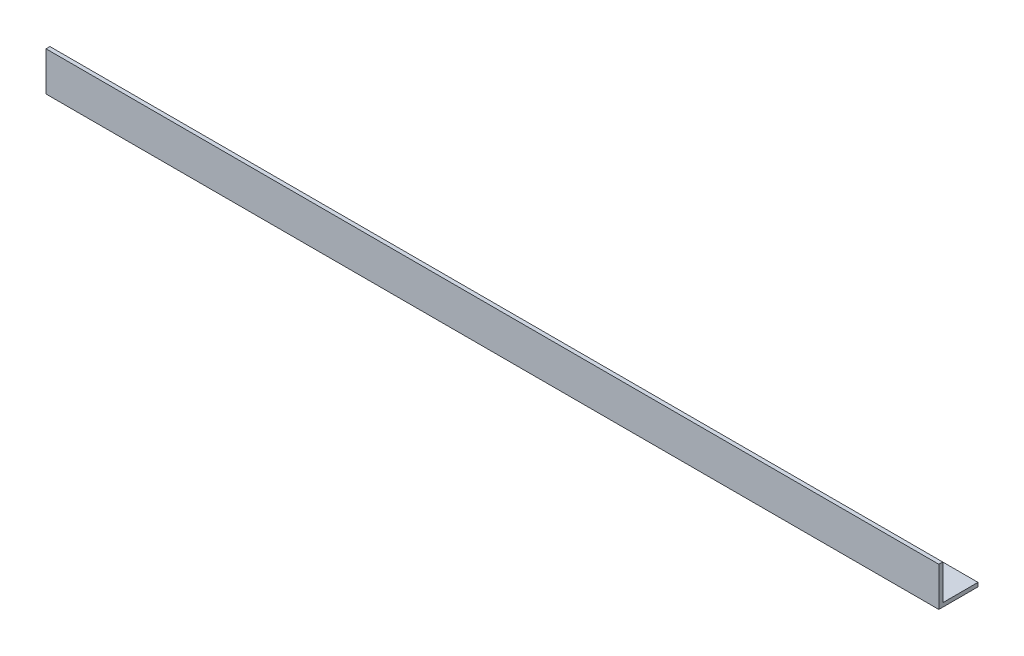
ISO-10303-21;
HEADER;
FILE_DESCRIPTION(('STEP AP214'),'2;1');
FILE_NAME('part.step','',(''),(''),'','','');
FILE_SCHEMA(('AUTOMOTIVE_DESIGN { 1 0 10303 214 1 1 1 1 }'));
ENDSEC;
DATA;
#1=APPLICATION_CONTEXT('core data for automotive mechanical design processes');
#2=APPLICATION_PROTOCOL_DEFINITION('international standard','automotive_design',2000,#1);
#3=PRODUCT_CONTEXT('',#1,'mechanical');
#4=PRODUCT('Part','Part','',(#3));
#5=PRODUCT_RELATED_PRODUCT_CATEGORY('part','',(#4));
#6=PRODUCT_DEFINITION_FORMATION('','',#4);
#7=PRODUCT_DEFINITION_CONTEXT('part definition',#1,'design');
#8=PRODUCT_DEFINITION('design','',#6,#7);
#9=PRODUCT_DEFINITION_SHAPE('','',#8);
#10=(LENGTH_UNIT() NAMED_UNIT(*) SI_UNIT(.MILLI.,.METRE.));
#11=(NAMED_UNIT(*) PLANE_ANGLE_UNIT() SI_UNIT($,.RADIAN.));
#12=(NAMED_UNIT(*) SI_UNIT($,.STERADIAN.) SOLID_ANGLE_UNIT());
#13=UNCERTAINTY_MEASURE_WITH_UNIT(LENGTH_MEASURE(1.E-05),#10,'distance_accuracy_value','');
#14=(GEOMETRIC_REPRESENTATION_CONTEXT(3) GLOBAL_UNCERTAINTY_ASSIGNED_CONTEXT((#13)) GLOBAL_UNIT_ASSIGNED_CONTEXT((#10,
#11,#12)) REPRESENTATION_CONTEXT('',''));
#15=CARTESIAN_POINT('',(0.,0.,0.));
#16=DIRECTION('',(0.,0.,1.));
#17=DIRECTION('',(1.,0.,0.));
#18=AXIS2_PLACEMENT_3D('',#15,#16,#17);
#19=CARTESIAN_POINT('',(342.,0.,-15.));
#20=DIRECTION('',(0.,1.,0.));
#21=DIRECTION('',(0.,0.,1.));
#22=AXIS2_PLACEMENT_3D('',#19,#20,#21);
#23=PLANE('',#22);
#24=DIRECTION('',(0.,0.,-1.));
#25=VECTOR('',#24,1.);
#26=CARTESIAN_POINT('',(0.,0.,-15.));
#27=LINE('',#26,#25);
#28=CARTESIAN_POINT('',(0.,0.,0.));
#29=VERTEX_POINT('',#28);
#30=CARTESIAN_POINT('',(0.,0.,-15.));
#31=VERTEX_POINT('',#30);
#32=EDGE_CURVE('E118',#29,#31,#27,.T.);
#33=ORIENTED_EDGE('',*,*,#32,.T.);
#34=DIRECTION('',(-1.,0.,0.));
#35=VECTOR('',#34,1.);
#36=CARTESIAN_POINT('',(342.,0.,-15.));
#37=LINE('',#36,#35);
#38=CARTESIAN_POINT('',(342.,0.,-15.));
#39=VERTEX_POINT('',#38);
#40=EDGE_CURVE('E11',#39,#31,#37,.T.);
#41=ORIENTED_EDGE('',*,*,#40,.F.);
#42=DIRECTION('',(0.,0.,-1.));
#43=VECTOR('',#42,1.);
#44=CARTESIAN_POINT('',(342.,0.,-15.));
#45=LINE('',#44,#43);
#46=CARTESIAN_POINT('',(342.,0.,0.));
#47=VERTEX_POINT('',#46);
#48=EDGE_CURVE('E128',#47,#39,#45,.T.);
#49=ORIENTED_EDGE('',*,*,#48,.F.);
#50=DIRECTION('',(-1.,0.,0.));
#51=VECTOR('',#50,1.);
#52=CARTESIAN_POINT('',(342.,0.,0.));
#53=LINE('',#52,#51);
#54=EDGE_CURVE('E114',#47,#29,#53,.T.);
#55=ORIENTED_EDGE('',*,*,#54,.T.);
#56=EDGE_LOOP('',(#33,#41,#49,#55));
#57=FACE_BOUND('',#56,.T.);
#58=ADVANCED_FACE('F34',(#57),#23,.F.);
#59=CARTESIAN_POINT('',(342.,1.49999999999998,-15.));
#60=DIRECTION('',(0.,0.,1.));
#61=DIRECTION('',(1.,0.,0.));
#62=AXIS2_PLACEMENT_3D('',#59,#60,#61);
#63=PLANE('',#62);
#64=DIRECTION('',(0.,1.,0.));
#65=VECTOR('',#64,1.);
#66=CARTESIAN_POINT('',(0.,1.49999999999998,-15.));
#67=LINE('',#66,#65);
#68=CARTESIAN_POINT('',(0.,1.49999999999998,-15.));
#69=VERTEX_POINT('',#68);
#70=EDGE_CURVE('E121',#31,#69,#67,.T.);
#71=ORIENTED_EDGE('',*,*,#70,.T.);
#72=DIRECTION('',(-1.,0.,0.));
#73=VECTOR('',#72,1.);
#74=CARTESIAN_POINT('',(342.,1.49999999999998,-15.));
#75=LINE('',#74,#73);
#76=CARTESIAN_POINT('',(342.,1.49999999999998,-15.));
#77=VERTEX_POINT('',#76);
#78=EDGE_CURVE('E42',#77,#69,#75,.T.);
#79=ORIENTED_EDGE('',*,*,#78,.F.);
#80=DIRECTION('',(0.,1.,0.));
#81=VECTOR('',#80,1.);
#82=CARTESIAN_POINT('',(342.,1.49999999999998,-15.));
#83=LINE('',#82,#81);
#84=EDGE_CURVE('E87',#39,#77,#83,.T.);
#85=ORIENTED_EDGE('',*,*,#84,.F.);
#86=ORIENTED_EDGE('',*,*,#40,.T.);
#87=EDGE_LOOP('',(#71,#79,#85,#86));
#88=FACE_BOUND('',#87,.T.);
#89=ADVANCED_FACE('F152',(#88),#63,.F.);
#90=CARTESIAN_POINT('',(342.,1.5,-1.50000000000002));
#91=DIRECTION('',(0.,-1.,0.));
#92=DIRECTION('',(0.,0.,-1.));
#93=AXIS2_PLACEMENT_3D('',#90,#91,#92);
#94=PLANE('',#93);
#95=DIRECTION('',(0.,0.,1.));
#96=VECTOR('',#95,1.);
#97=CARTESIAN_POINT('',(0.,1.5,-1.50000000000002));
#98=LINE('',#97,#96);
#99=CARTESIAN_POINT('',(0.,1.5,-1.50000000000002));
#100=VERTEX_POINT('',#99);
#101=EDGE_CURVE('E123',#69,#100,#98,.T.);
#102=ORIENTED_EDGE('',*,*,#101,.T.);
#103=DIRECTION('',(-1.,0.,0.));
#104=VECTOR('',#103,1.);
#105=CARTESIAN_POINT('',(342.,1.5,-1.50000000000002));
#106=LINE('',#105,#104);
#107=CARTESIAN_POINT('',(342.,1.5,-1.50000000000002));
#108=VERTEX_POINT('',#107);
#109=EDGE_CURVE('E109',#108,#100,#106,.T.);
#110=ORIENTED_EDGE('',*,*,#109,.F.);
#111=DIRECTION('',(0.,0.,1.));
#112=VECTOR('',#111,1.);
#113=CARTESIAN_POINT('',(342.,1.5,-1.50000000000002));
#114=LINE('',#113,#112);
#115=EDGE_CURVE('E100',#77,#108,#114,.T.);
#116=ORIENTED_EDGE('',*,*,#115,.F.);
#117=ORIENTED_EDGE('',*,*,#78,.T.);
#118=EDGE_LOOP('',(#102,#110,#116,#117));
#119=FACE_BOUND('',#118,.T.);
#120=ADVANCED_FACE('F134',(#119),#94,.F.);
#121=CARTESIAN_POINT('',(342.,15.,-1.5));
#122=DIRECTION('',(0.,0.,1.));
#123=DIRECTION('',(0.,-1.,0.));
#124=AXIS2_PLACEMENT_3D('',#121,#122,#123);
#125=PLANE('',#124);
#126=DIRECTION('',(0.,1.,0.));
#127=VECTOR('',#126,1.);
#128=CARTESIAN_POINT('',(0.,15.,-1.5));
#129=LINE('',#128,#127);
#130=CARTESIAN_POINT('',(0.,15.,-1.5));
#131=VERTEX_POINT('',#130);
#132=EDGE_CURVE('E108',#100,#131,#129,.T.);
#133=ORIENTED_EDGE('',*,*,#132,.T.);
#134=DIRECTION('',(-1.,0.,0.));
#135=VECTOR('',#134,1.);
#136=CARTESIAN_POINT('',(342.,15.,-1.5));
#137=LINE('',#136,#135);
#138=CARTESIAN_POINT('',(342.,15.,-1.5));
#139=VERTEX_POINT('',#138);
#140=EDGE_CURVE('E105',#139,#131,#137,.T.);
#141=ORIENTED_EDGE('',*,*,#140,.F.);
#142=DIRECTION('',(0.,1.,0.));
#143=VECTOR('',#142,1.);
#144=CARTESIAN_POINT('',(342.,15.,-1.5));
#145=LINE('',#144,#143);
#146=EDGE_CURVE('E94',#108,#139,#145,.T.);
#147=ORIENTED_EDGE('',*,*,#146,.F.);
#148=ORIENTED_EDGE('',*,*,#109,.T.);
#149=EDGE_LOOP('',(#133,#141,#147,#148));
#150=FACE_BOUND('',#149,.T.);
#151=ADVANCED_FACE('F106',(#150),#125,.F.);
#152=CARTESIAN_POINT('',(342.,15.,0.));
#153=DIRECTION('',(0.,-1.,0.));
#154=DIRECTION('',(0.,0.,-1.));
#155=AXIS2_PLACEMENT_3D('',#152,#153,#154);
#156=PLANE('',#155);
#157=DIRECTION('',(0.,0.,1.));
#158=VECTOR('',#157,1.);
#159=CARTESIAN_POINT('',(0.,15.,0.));
#160=LINE('',#159,#158);
#161=CARTESIAN_POINT('',(0.,15.,0.));
#162=VERTEX_POINT('',#161);
#163=EDGE_CURVE('E73',#131,#162,#160,.T.);
#164=ORIENTED_EDGE('',*,*,#163,.T.);
#165=DIRECTION('',(-1.,0.,0.));
#166=VECTOR('',#165,1.);
#167=CARTESIAN_POINT('',(342.,15.,0.));
#168=LINE('',#167,#166);
#169=CARTESIAN_POINT('',(342.,15.,0.));
#170=VERTEX_POINT('',#169);
#171=EDGE_CURVE('E110',#170,#162,#168,.T.);
#172=ORIENTED_EDGE('',*,*,#171,.F.);
#173=DIRECTION('',(0.,0.,1.));
#174=VECTOR('',#173,1.);
#175=CARTESIAN_POINT('',(342.,15.,0.));
#176=LINE('',#175,#174);
#177=EDGE_CURVE('E98',#139,#170,#176,.T.);
#178=ORIENTED_EDGE('',*,*,#177,.F.);
#179=ORIENTED_EDGE('',*,*,#140,.T.);
#180=EDGE_LOOP('',(#164,#172,#178,#179));
#181=FACE_BOUND('',#180,.T.);
#182=ADVANCED_FACE('F112',(#181),#156,.F.);
#183=CARTESIAN_POINT('',(342.,0.,0.));
#184=DIRECTION('',(0.,0.,-1.));
#185=DIRECTION('',(-1.,0.,0.));
#186=AXIS2_PLACEMENT_3D('',#183,#184,#185);
#187=PLANE('',#186);
#188=DIRECTION('',(0.,-1.,0.));
#189=VECTOR('',#188,1.);
#190=CARTESIAN_POINT('',(0.,0.,0.));
#191=LINE('',#190,#189);
#192=EDGE_CURVE('E79',#162,#29,#191,.T.);
#193=ORIENTED_EDGE('',*,*,#192,.T.);
#194=ORIENTED_EDGE('',*,*,#54,.F.);
#195=DIRECTION('',(0.,-1.,0.));
#196=VECTOR('',#195,1.);
#197=CARTESIAN_POINT('',(342.,0.,0.));
#198=LINE('',#197,#196);
#199=EDGE_CURVE('E50',#170,#47,#198,.T.);
#200=ORIENTED_EDGE('',*,*,#199,.F.);
#201=ORIENTED_EDGE('',*,*,#171,.T.);
#202=EDGE_LOOP('',(#193,#194,#200,#201));
#203=FACE_BOUND('',#202,.T.);
#204=ADVANCED_FACE('F141',(#203),#187,.F.);
#205=CARTESIAN_POINT('',(342.,0.,0.));
#206=DIRECTION('',(-1.,0.,0.));
#207=DIRECTION('',(0.,0.,1.));
#208=AXIS2_PLACEMENT_3D('',#205,#206,#207);
#209=PLANE('',#208);
#210=ORIENTED_EDGE('',*,*,#48,.T.);
#211=ORIENTED_EDGE('',*,*,#84,.T.);
#212=ORIENTED_EDGE('',*,*,#115,.T.);
#213=ORIENTED_EDGE('',*,*,#146,.T.);
#214=ORIENTED_EDGE('',*,*,#177,.T.);
#215=ORIENTED_EDGE('',*,*,#199,.T.);
#216=EDGE_LOOP('',(#210,#211,#212,#213,#214,#215));
#217=FACE_BOUND('',#216,.T.);
#218=ADVANCED_FACE('F96',(#217),#209,.F.);
#219=CARTESIAN_POINT('',(0.,0.,0.));
#220=DIRECTION('',(-1.,0.,0.));
#221=DIRECTION('',(0.,0.,1.));
#222=AXIS2_PLACEMENT_3D('',#219,#220,#221);
#223=PLANE('',#222);
#224=ORIENTED_EDGE('',*,*,#32,.F.);
#225=ORIENTED_EDGE('',*,*,#192,.F.);
#226=ORIENTED_EDGE('',*,*,#163,.F.);
#227=ORIENTED_EDGE('',*,*,#132,.F.);
#228=ORIENTED_EDGE('',*,*,#101,.F.);
#229=ORIENTED_EDGE('',*,*,#70,.F.);
#230=EDGE_LOOP('',(#224,#225,#226,#227,#228,#229));
#231=FACE_BOUND('',#230,.T.);
#232=ADVANCED_FACE('F137',(#231),#223,.T.);
#233=CLOSED_SHELL('',(#58,#89,#120,#151,#182,#204,#218,#232));
#234=MANIFOLD_SOLID_BREP('B2',#233);
#235=ADVANCED_BREP_SHAPE_REPRESENTATION('',(#18,#234),#14);
#236=SHAPE_DEFINITION_REPRESENTATION(#9,#235);
ENDSEC;
END-ISO-10303-21;
